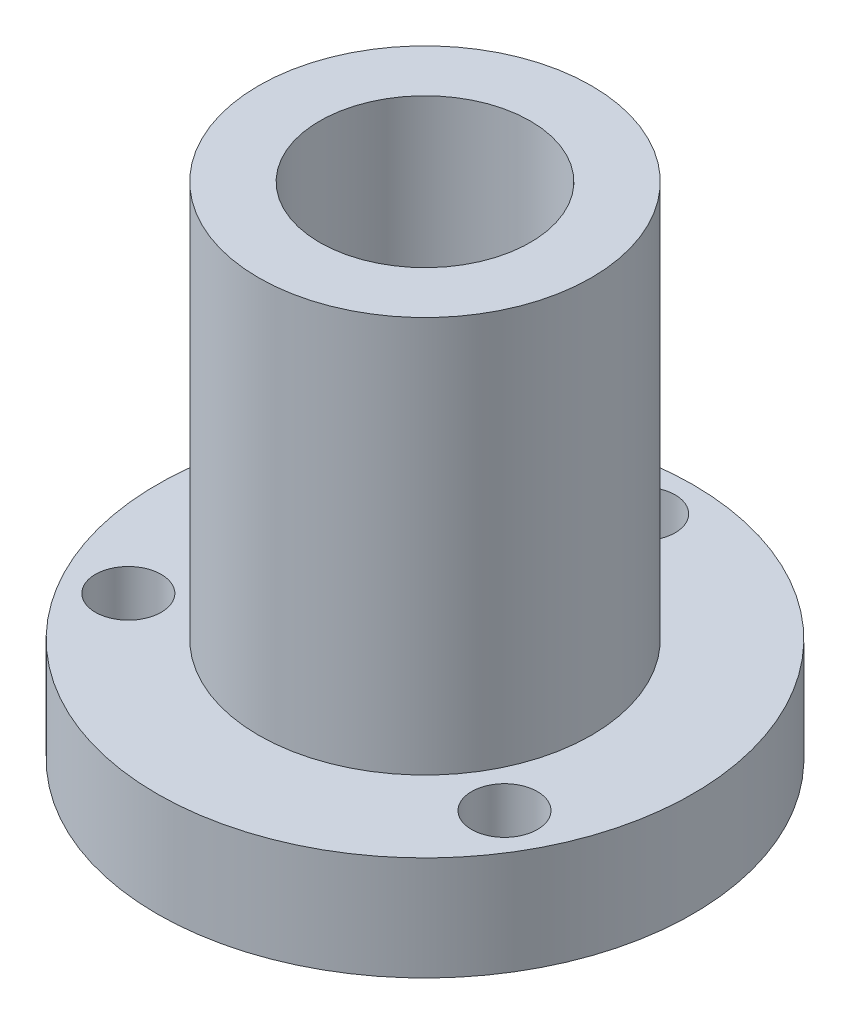
ISO-10303-21;
HEADER;
FILE_DESCRIPTION(('STEP AP214'),'2;1');
FILE_NAME('part.step','',(''),(''),'','','');
FILE_SCHEMA(('AUTOMOTIVE_DESIGN { 1 0 10303 214 1 1 1 1 }'));
ENDSEC;
DATA;
#1=APPLICATION_CONTEXT('core data for automotive mechanical design processes');
#2=APPLICATION_PROTOCOL_DEFINITION('international standard','automotive_design',2000,#1);
#3=PRODUCT_CONTEXT('',#1,'mechanical');
#4=PRODUCT('Part','Part','',(#3));
#5=PRODUCT_RELATED_PRODUCT_CATEGORY('part','',(#4));
#6=PRODUCT_DEFINITION_FORMATION('','',#4);
#7=PRODUCT_DEFINITION_CONTEXT('part definition',#1,'design');
#8=PRODUCT_DEFINITION('design','',#6,#7);
#9=PRODUCT_DEFINITION_SHAPE('','',#8);
#10=(LENGTH_UNIT() NAMED_UNIT(*) SI_UNIT(.MILLI.,.METRE.));
#11=(NAMED_UNIT(*) PLANE_ANGLE_UNIT() SI_UNIT($,.RADIAN.));
#12=(NAMED_UNIT(*) SI_UNIT($,.STERADIAN.) SOLID_ANGLE_UNIT());
#13=UNCERTAINTY_MEASURE_WITH_UNIT(LENGTH_MEASURE(1.E-05),#10,'distance_accuracy_value','');
#14=(GEOMETRIC_REPRESENTATION_CONTEXT(3) GLOBAL_UNCERTAINTY_ASSIGNED_CONTEXT((#13)) GLOBAL_UNIT_ASSIGNED_CONTEXT((#10,
#11,#12)) REPRESENTATION_CONTEXT('',''));
#15=CARTESIAN_POINT('',(0.,0.,0.));
#16=DIRECTION('',(0.,0.,1.));
#17=DIRECTION('',(1.,0.,0.));
#18=AXIS2_PLACEMENT_3D('',#15,#16,#17);
#19=CARTESIAN_POINT('',(0.,3.95,0.));
#20=DIRECTION('',(0.,1.,0.));
#21=DIRECTION('',(0.,0.,1.));
#22=AXIS2_PLACEMENT_3D('',#19,#20,#21);
#23=PLANE('',#22);
#24=CARTESIAN_POINT('',(-7.14470958122162,3.95,4.12500000000001));
#25=DIRECTION('',(0.,1.,0.));
#26=DIRECTION('',(0.,0.,1.));
#27=AXIS2_PLACEMENT_3D('',#24,#25,#26);
#28=CIRCLE('',#27,1.25);
#29=CARTESIAN_POINT('',(-7.14470958122162,3.95,5.375));
#30=VERTEX_POINT('',#29);
#31=EDGE_CURVE('E71',#30,#30,#28,.T.);
#32=ORIENTED_EDGE('',*,*,#31,.F.);
#33=EDGE_LOOP('',(#32));
#34=FACE_BOUND('',#33,.T.);
#35=CARTESIAN_POINT('',(7.14470958122162,3.95,4.12500000000001));
#36=DIRECTION('',(0.,1.,0.));
#37=DIRECTION('',(0.,0.,1.));
#38=AXIS2_PLACEMENT_3D('',#35,#36,#37);
#39=CIRCLE('',#38,1.25);
#40=CARTESIAN_POINT('',(7.14470958122162,3.95,5.375));
#41=VERTEX_POINT('',#40);
#42=EDGE_CURVE('E65',#41,#41,#39,.T.);
#43=ORIENTED_EDGE('',*,*,#42,.F.);
#44=EDGE_LOOP('',(#43));
#45=FACE_BOUND('',#44,.T.);
#46=CARTESIAN_POINT('',(0.,3.95,-8.25));
#47=DIRECTION('',(0.,1.,0.));
#48=DIRECTION('',(0.,0.,1.));
#49=AXIS2_PLACEMENT_3D('',#46,#47,#48);
#50=CIRCLE('',#49,1.25);
#51=CARTESIAN_POINT('',(0.,3.95,-7.));
#52=VERTEX_POINT('',#51);
#53=EDGE_CURVE('E54',#52,#52,#50,.T.);
#54=ORIENTED_EDGE('',*,*,#53,.F.);
#55=EDGE_LOOP('',(#54));
#56=FACE_BOUND('',#55,.T.);
#57=CARTESIAN_POINT('',(0.,3.95,0.));
#58=DIRECTION('',(0.,1.,0.));
#59=DIRECTION('',(0.,0.,1.));
#60=AXIS2_PLACEMENT_3D('',#57,#58,#59);
#61=CIRCLE('',#60,10.175);
#62=CARTESIAN_POINT('',(0.,3.95,10.175));
#63=VERTEX_POINT('',#62);
#64=EDGE_CURVE('E11',#63,#63,#61,.T.);
#65=ORIENTED_EDGE('',*,*,#64,.T.);
#66=EDGE_LOOP('',(#65));
#67=FACE_BOUND('',#66,.T.);
#68=CARTESIAN_POINT('',(0.,3.95,0.));
#69=DIRECTION('',(0.,1.,0.));
#70=DIRECTION('',(0.,0.,1.));
#71=AXIS2_PLACEMENT_3D('',#68,#69,#70);
#72=CIRCLE('',#71,6.32);
#73=CARTESIAN_POINT('',(0.,3.95,6.32));
#74=VERTEX_POINT('',#73);
#75=EDGE_CURVE('E53',#74,#74,#72,.T.);
#76=ORIENTED_EDGE('',*,*,#75,.F.);
#77=EDGE_LOOP('',(#76));
#78=FACE_BOUND('',#77,.T.);
#79=ADVANCED_FACE('F34',(#34,#45,#56,#67,#78),#23,.T.);
#80=CARTESIAN_POINT('',(0.,0.,0.));
#81=DIRECTION('',(0.,1.,0.));
#82=DIRECTION('',(0.,0.,1.));
#83=AXIS2_PLACEMENT_3D('',#80,#81,#82);
#84=PLANE('',#83);
#85=CARTESIAN_POINT('',(-7.14470958122162,0.,4.12500000000001));
#86=DIRECTION('',(0.,-1.,0.));
#87=DIRECTION('',(0.,0.,-1.));
#88=AXIS2_PLACEMENT_3D('',#85,#86,#87);
#89=CIRCLE('',#88,1.25);
#90=CARTESIAN_POINT('',(-7.14470958122162,0.,2.87500000000001));
#91=VERTEX_POINT('',#90);
#92=EDGE_CURVE('E74',#91,#91,#89,.T.);
#93=ORIENTED_EDGE('',*,*,#92,.F.);
#94=EDGE_LOOP('',(#93));
#95=FACE_BOUND('',#94,.T.);
#96=CARTESIAN_POINT('',(7.14470958122162,0.,4.12500000000001));
#97=DIRECTION('',(0.,-1.,0.));
#98=DIRECTION('',(0.,0.,-1.));
#99=AXIS2_PLACEMENT_3D('',#96,#97,#98);
#100=CIRCLE('',#99,1.25);
#101=CARTESIAN_POINT('',(7.14470958122162,0.,2.87500000000001));
#102=VERTEX_POINT('',#101);
#103=EDGE_CURVE('E68',#102,#102,#100,.T.);
#104=ORIENTED_EDGE('',*,*,#103,.F.);
#105=EDGE_LOOP('',(#104));
#106=FACE_BOUND('',#105,.T.);
#107=CARTESIAN_POINT('',(0.,0.,-8.25));
#108=DIRECTION('',(0.,-1.,0.));
#109=DIRECTION('',(0.,0.,-1.));
#110=AXIS2_PLACEMENT_3D('',#107,#108,#109);
#111=CIRCLE('',#110,1.25);
#112=CARTESIAN_POINT('',(0.,0.,-9.5));
#113=VERTEX_POINT('',#112);
#114=EDGE_CURVE('E62',#113,#113,#111,.T.);
#115=ORIENTED_EDGE('',*,*,#114,.F.);
#116=EDGE_LOOP('',(#115));
#117=FACE_BOUND('',#116,.T.);
#118=CARTESIAN_POINT('',(0.,0.,0.));
#119=DIRECTION('',(0.,1.,0.));
#120=DIRECTION('',(0.,0.,1.));
#121=AXIS2_PLACEMENT_3D('',#118,#119,#120);
#122=CIRCLE('',#121,10.175);
#123=CARTESIAN_POINT('',(0.,0.,10.175));
#124=VERTEX_POINT('',#123);
#125=EDGE_CURVE('E38',#124,#124,#122,.T.);
#126=ORIENTED_EDGE('',*,*,#125,.F.);
#127=EDGE_LOOP('',(#126));
#128=FACE_BOUND('',#127,.T.);
#129=CARTESIAN_POINT('',(0.,0.,0.));
#130=DIRECTION('',(0.,1.,0.));
#131=DIRECTION('',(0.,0.,1.));
#132=AXIS2_PLACEMENT_3D('',#129,#130,#131);
#133=CIRCLE('',#132,4.);
#134=CARTESIAN_POINT('',(0.,0.,4.));
#135=VERTEX_POINT('',#134);
#136=EDGE_CURVE('E45',#135,#135,#133,.T.);
#137=ORIENTED_EDGE('',*,*,#136,.T.);
#138=EDGE_LOOP('',(#137));
#139=FACE_BOUND('',#138,.T.);
#140=ADVANCED_FACE('F81',(#95,#106,#117,#128,#139),#84,.F.);
#141=CARTESIAN_POINT('',(0.,3.95,0.));
#142=DIRECTION('',(0.,-1.,0.));
#143=DIRECTION('',(0.,0.,-1.));
#144=AXIS2_PLACEMENT_3D('',#141,#142,#143);
#145=CYLINDRICAL_SURFACE('',#144,10.175);
#146=ORIENTED_EDGE('',*,*,#64,.F.);
#147=EDGE_LOOP('',(#146));
#148=FACE_BOUND('',#147,.T.);
#149=ORIENTED_EDGE('',*,*,#125,.T.);
#150=EDGE_LOOP('',(#149));
#151=FACE_BOUND('',#150,.T.);
#152=ADVANCED_FACE('F36',(#148,#151),#145,.T.);
#153=CARTESIAN_POINT('',(0.,3.95,0.));
#154=DIRECTION('',(0.,-1.,0.));
#155=DIRECTION('',(0.,0.,-1.));
#156=AXIS2_PLACEMENT_3D('',#153,#154,#155);
#157=CYLINDRICAL_SURFACE('',#156,4.);
#158=ORIENTED_EDGE('',*,*,#136,.F.);
#159=EDGE_LOOP('',(#158));
#160=FACE_BOUND('',#159,.T.);
#161=CARTESIAN_POINT('',(0.,19.,0.));
#162=DIRECTION('',(0.,1.,0.));
#163=DIRECTION('',(0.,0.,1.));
#164=AXIS2_PLACEMENT_3D('',#161,#162,#163);
#165=CIRCLE('',#164,4.);
#166=CARTESIAN_POINT('',(0.,19.,4.));
#167=VERTEX_POINT('',#166);
#168=EDGE_CURVE('E50',#167,#167,#165,.T.);
#169=ORIENTED_EDGE('',*,*,#168,.T.);
#170=EDGE_LOOP('',(#169));
#171=FACE_BOUND('',#170,.T.);
#172=ADVANCED_FACE('F92',(#160,#171),#157,.F.);
#173=CARTESIAN_POINT('',(0.,55.8756594283959,0.));
#174=DIRECTION('',(0.,-1.,0.));
#175=DIRECTION('',(0.,0.,-1.));
#176=AXIS2_PLACEMENT_3D('',#173,#174,#175);
#177=CYLINDRICAL_SURFACE('',#176,6.32);
#178=ORIENTED_EDGE('',*,*,#75,.T.);
#179=EDGE_LOOP('',(#178));
#180=FACE_BOUND('',#179,.T.);
#181=CARTESIAN_POINT('',(0.,19.,0.));
#182=DIRECTION('',(0.,1.,0.));
#183=DIRECTION('',(0.,0.,1.));
#184=AXIS2_PLACEMENT_3D('',#181,#182,#183);
#185=CIRCLE('',#184,6.32);
#186=CARTESIAN_POINT('',(0.,19.,6.32));
#187=VERTEX_POINT('',#186);
#188=EDGE_CURVE('E49',#187,#187,#185,.T.);
#189=ORIENTED_EDGE('',*,*,#188,.F.);
#190=EDGE_LOOP('',(#189));
#191=FACE_BOUND('',#190,.T.);
#192=ADVANCED_FACE('F95',(#180,#191),#177,.T.);
#193=CARTESIAN_POINT('',(0.,19.,0.));
#194=DIRECTION('',(0.,1.,0.));
#195=DIRECTION('',(0.,0.,1.));
#196=AXIS2_PLACEMENT_3D('',#193,#194,#195);
#197=PLANE('',#196);
#198=ORIENTED_EDGE('',*,*,#168,.F.);
#199=EDGE_LOOP('',(#198));
#200=FACE_BOUND('',#199,.T.);
#201=ORIENTED_EDGE('',*,*,#188,.T.);
#202=EDGE_LOOP('',(#201));
#203=FACE_BOUND('',#202,.T.);
#204=ADVANCED_FACE('F99',(#200,#203),#197,.T.);
#205=CARTESIAN_POINT('',(0.,0.,-8.25));
#206=DIRECTION('',(0.,-1.,0.));
#207=DIRECTION('',(0.,0.,-1.));
#208=AXIS2_PLACEMENT_3D('',#205,#206,#207);
#209=CYLINDRICAL_SURFACE('',#208,1.25);
#210=ORIENTED_EDGE('',*,*,#114,.T.);
#211=EDGE_LOOP('',(#210));
#212=FACE_BOUND('',#211,.T.);
#213=ORIENTED_EDGE('',*,*,#53,.T.);
#214=EDGE_LOOP('',(#213));
#215=FACE_BOUND('',#214,.T.);
#216=ADVANCED_FACE('F102',(#212,#215),#209,.F.);
#217=CARTESIAN_POINT('',(7.14470958122162,0.,4.12500000000001));
#218=DIRECTION('',(0.,-1.,0.));
#219=DIRECTION('',(0.,0.,-1.));
#220=AXIS2_PLACEMENT_3D('',#217,#218,#219);
#221=CYLINDRICAL_SURFACE('',#220,1.25);
#222=ORIENTED_EDGE('',*,*,#103,.T.);
#223=EDGE_LOOP('',(#222));
#224=FACE_BOUND('',#223,.T.);
#225=ORIENTED_EDGE('',*,*,#42,.T.);
#226=EDGE_LOOP('',(#225));
#227=FACE_BOUND('',#226,.T.);
#228=ADVANCED_FACE('F125',(#224,#227),#221,.F.);
#229=CARTESIAN_POINT('',(-7.14470958122162,0.,4.12500000000001));
#230=DIRECTION('',(0.,-1.,0.));
#231=DIRECTION('',(0.,0.,-1.));
#232=AXIS2_PLACEMENT_3D('',#229,#230,#231);
#233=CYLINDRICAL_SURFACE('',#232,1.25);
#234=ORIENTED_EDGE('',*,*,#92,.T.);
#235=EDGE_LOOP('',(#234));
#236=FACE_BOUND('',#235,.T.);
#237=ORIENTED_EDGE('',*,*,#31,.T.);
#238=EDGE_LOOP('',(#237));
#239=FACE_BOUND('',#238,.T.);
#240=ADVANCED_FACE('F78',(#236,#239),#233,.F.);
#241=CLOSED_SHELL('',(#79,#140,#152,#172,#192,#204,#216,#228,#240));
#242=MANIFOLD_SOLID_BREP('B2',#241);
#243=ADVANCED_BREP_SHAPE_REPRESENTATION('',(#18,#242),#14);
#244=SHAPE_DEFINITION_REPRESENTATION(#9,#243);
ENDSEC;
END-ISO-10303-21;
